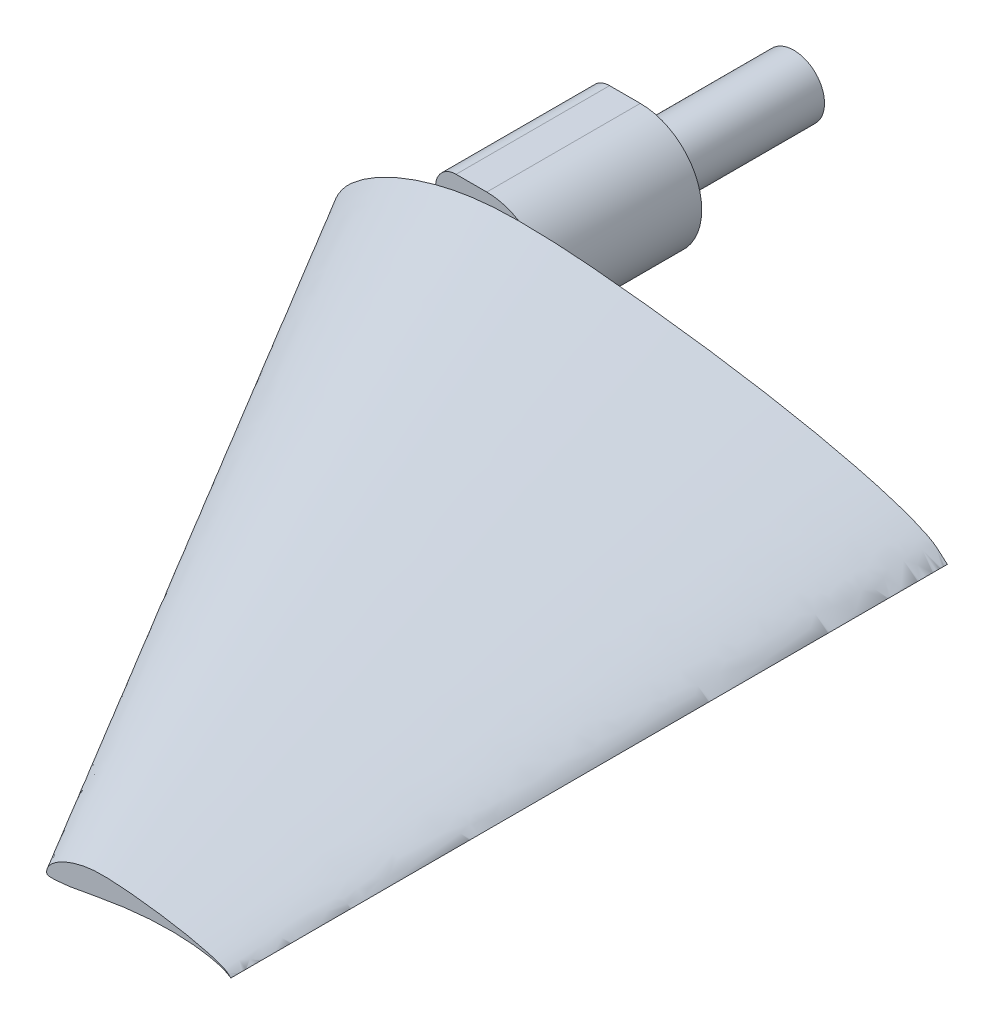
ISO-10303-21;
HEADER;
FILE_DESCRIPTION(('STEP AP214'),'2;1');
FILE_NAME('part.step','',(''),(''),'','','');
FILE_SCHEMA(('AUTOMOTIVE_DESIGN { 1 0 10303 214 1 1 1 1 }'));
ENDSEC;
DATA;
#1=APPLICATION_CONTEXT('core data for automotive mechanical design processes');
#2=APPLICATION_PROTOCOL_DEFINITION('international standard','automotive_design',2000,#1);
#3=PRODUCT_CONTEXT('',#1,'mechanical');
#4=PRODUCT('Part','Part','',(#3));
#5=PRODUCT_RELATED_PRODUCT_CATEGORY('part','',(#4));
#6=PRODUCT_DEFINITION_FORMATION('','',#4);
#7=PRODUCT_DEFINITION_CONTEXT('part definition',#1,'design');
#8=PRODUCT_DEFINITION('design','',#6,#7);
#9=PRODUCT_DEFINITION_SHAPE('','',#8);
#10=(LENGTH_UNIT() NAMED_UNIT(*) SI_UNIT(.MILLI.,.METRE.));
#11=(NAMED_UNIT(*) PLANE_ANGLE_UNIT() SI_UNIT($,.RADIAN.));
#12=(NAMED_UNIT(*) SI_UNIT($,.STERADIAN.) SOLID_ANGLE_UNIT());
#13=UNCERTAINTY_MEASURE_WITH_UNIT(LENGTH_MEASURE(1.E-05),#10,'distance_accuracy_value','');
#14=(GEOMETRIC_REPRESENTATION_CONTEXT(3) GLOBAL_UNCERTAINTY_ASSIGNED_CONTEXT((#13)) GLOBAL_UNIT_ASSIGNED_CONTEXT((#10,
#11,#12)) REPRESENTATION_CONTEXT('',''));
#15=CARTESIAN_POINT('',(0.,0.,0.));
#16=DIRECTION('',(0.,0.,1.));
#17=DIRECTION('',(1.,0.,0.));
#18=AXIS2_PLACEMENT_3D('',#15,#16,#17);
#19=CARTESIAN_POINT('',(0.358648893938825,1.31203835702179,0.));
#20=DIRECTION('',(0.,0.,-1.));
#21=DIRECTION('',(-1.,0.,0.));
#22=AXIS2_PLACEMENT_3D('',#19,#20,#21);
#23=PLANE('',#22);
#24=CARTESIAN_POINT('',(60.,0.,0.));
#25=CARTESIAN_POINT('',(60.0003591967076,0.00152743166866113,0.));
#26=CARTESIAN_POINT('',(59.8031171503171,0.148486190866981,0.));
#27=CARTESIAN_POINT('',(59.6363051275394,0.312157693204799,0.));
#28=CARTESIAN_POINT('',(59.265915035483,0.654017791026096,0.));
#29=CARTESIAN_POINT('',(58.828941407944,1.01769187040323,0.));
#30=CARTESIAN_POINT('',(58.2311986071286,1.38431433802317,0.));
#31=CARTESIAN_POINT('',(57.4879028587413,1.73962008144949,0.));
#32=CARTESIAN_POINT('',(56.5905605509476,2.11038996867272,0.));
#33=CARTESIAN_POINT('',(55.5405906841004,2.49165505155028,0.));
#34=CARTESIAN_POINT('',(54.3426606505066,2.87984653664435,0.));
#35=CARTESIAN_POINT('',(53.0044503542957,3.27530791932623,0.));
#36=CARTESIAN_POINT('',(51.5282398733248,3.65993308110928,0.));
#37=CARTESIAN_POINT('',(49.9318628263046,4.06561454332629,0.));
#38=CARTESIAN_POINT('',(48.2145350695117,4.45252726033602,0.));
#39=CARTESIAN_POINT('',(46.3922162813386,4.8372114388325,0.));
#40=CARTESIAN_POINT('',(44.4741846373565,5.21215240354569,0.));
#41=CARTESIAN_POINT('',(42.4720640696188,5.57436949248205,0.));
#42=CARTESIAN_POINT('',(40.3983436281798,5.92287598001367,0.));
#43=CARTESIAN_POINT('',(38.2650079778576,6.25331693697473,0.));
#44=CARTESIAN_POINT('',(36.0858440170008,6.56630027476171,0.));
#45=CARTESIAN_POINT('',(33.8748202071201,6.85935611065016,0.));
#46=CARTESIAN_POINT('',(31.6479502828675,7.13154383170439,0.));
#47=CARTESIAN_POINT('',(29.4230365764783,7.38479145195094,0.));
#48=CARTESIAN_POINT('',(27.2184980068069,7.61270867154978,0.));
#49=CARTESIAN_POINT('',(25.052294626095,7.81102981614016,0.));
#50=CARTESIAN_POINT('',(22.9396617347882,7.96859227406435,0.));
#51=CARTESIAN_POINT('',(20.8926674686435,8.07697502334032,0.));
#52=CARTESIAN_POINT('',(18.9226999256131,8.12377974427893,0.));
#53=CARTESIAN_POINT('',(17.0398509693804,8.11879768752978,0.));
#54=CARTESIAN_POINT('',(15.2476328415943,8.02660789751006,0.));
#55=CARTESIAN_POINT('',(13.5453512859509,7.839789441016,0.));
#56=CARTESIAN_POINT('',(11.926076695069,7.57562537309296,0.));
#57=CARTESIAN_POINT('',(10.3894182556015,7.23340315512576,0.));
#58=CARTESIAN_POINT('',(8.93695465998708,6.83209986705336,0.));
#59=CARTESIAN_POINT('',(7.57483146116029,6.37882320453374,0.));
#60=CARTESIAN_POINT('',(6.30884164347269,5.88417305863267,0.));
#61=CARTESIAN_POINT('',(5.14685221592727,5.35079958311253,0.));
#62=CARTESIAN_POINT('',(4.09258962341009,4.78953179393415,0.));
#63=CARTESIAN_POINT('',(3.15178940082182,4.20675239007223,0.));
#64=CARTESIAN_POINT('',(2.33035140361199,3.61035853790743,0.));
#65=CARTESIAN_POINT('',(1.62861455630535,3.01299152689761,0.));
#66=CARTESIAN_POINT('',(1.05675527613261,2.40813064719845,0.));
#67=CARTESIAN_POINT('',(0.617494407148315,1.80101400701995,0.));
#68=CARTESIAN_POINT('',(0.2930234664486,1.21037036917539,0.));
#69=CARTESIAN_POINT('',(0.0850719316488285,0.649582218808172,0.));
#70=CARTESIAN_POINT('',(-0.0140169847637187,0.131974925650224,0.));
#71=CARTESIAN_POINT('',(0.0051098577528765,-0.305798157678561,0.));
#72=CARTESIAN_POINT('',(0.117816244960925,-0.707306615975616,0.));
#73=CARTESIAN_POINT('',(0.536763933386814,-0.90661835605631,0.));
#74=CARTESIAN_POINT('',(1.10004460153965,-0.934581165480218,0.));
#75=CARTESIAN_POINT('',(1.8706104555078,-0.961682830343907,0.));
#76=CARTESIAN_POINT('',(2.8396514000118,-0.919895750020732,0.));
#77=CARTESIAN_POINT('',(3.99621535818404,-0.843103830870702,0.));
#78=CARTESIAN_POINT('',(5.3274309804443,-0.720099828376295,0.));
#79=CARTESIAN_POINT('',(6.81967624191513,-0.553670124333049,0.));
#80=CARTESIAN_POINT('',(8.46567456259763,-0.340243437522128,0.));
#81=CARTESIAN_POINT('',(10.2646215673956,-0.0419478858174395,0.));
#82=CARTESIAN_POINT('',(12.2252761749415,0.332109900745339,0.));
#83=CARTESIAN_POINT('',(14.3574403385057,0.739204137605637,0.));
#84=CARTESIAN_POINT('',(16.650692213626,1.16903728804964,0.));
#85=CARTESIAN_POINT('',(19.0906277666481,1.60376835003282,0.));
#86=CARTESIAN_POINT('',(21.6593280235428,2.02708237663987,0.));
#87=CARTESIAN_POINT('',(24.3368648292331,2.42484380478589,0.));
#88=CARTESIAN_POINT('',(27.1001632949703,2.78246131453942,0.));
#89=CARTESIAN_POINT('',(29.9243738514525,3.08952194695553,0.));
#90=CARTESIAN_POINT('',(32.7828181702501,3.33224073356768,0.));
#91=CARTESIAN_POINT('',(35.6468110581785,3.5042984247576,0.));
#92=CARTESIAN_POINT('',(38.4864311413307,3.59888806789702,0.));
#93=CARTESIAN_POINT('',(41.270873524825,3.61083541756505,0.));
#94=CARTESIAN_POINT('',(43.9690733929395,3.53932870712883,0.));
#95=CARTESIAN_POINT('',(46.5501347587453,3.38604192261378,0.));
#96=CARTESIAN_POINT('',(48.9830207247781,3.15295287632235,0.));
#97=CARTESIAN_POINT('',(51.2387663269364,2.84900866508274,0.));
#98=CARTESIAN_POINT('',(53.2880024798237,2.48302860424677,0.));
#99=CARTESIAN_POINT('',(55.1067027969541,2.06726981959666,0.));
#100=CARTESIAN_POINT('',(56.6613494668884,1.62238939798338,0.));
#101=CARTESIAN_POINT('',(57.9336674364374,1.14757460538814,0.));
#102=CARTESIAN_POINT('',(58.8414335563824,0.71305828177372,0.));
#103=CARTESIAN_POINT('',(59.510705283188,0.311289893981384,0.));
#104=CARTESIAN_POINT('',(59.7678107009083,0.155812155482037,0.));
#105=CARTESIAN_POINT('',(59.9996335008558,-0.00155848421639207,0.));
#106=CARTESIAN_POINT('',(60.,0.,0.));
#107=B_SPLINE_CURVE_WITH_KNOTS('',3,(#24,#25,#26,#27,#28,#29,#30,#31,#32,#33,#34,#35,#36,#37,
#38,#39,#40,#41,#42,#43,#44,#45,#46,#47,#48,#49,#50,#51,#52,#53,#54,#55,#56,#57,#58,#59,#60,#61,
#62,#63,#64,#65,#66,#67,#68,#69,#70,#71,#72,#73,#74,#75,#76,#77,#78,#79,#80,#81,#82,#83,#84,#85,
#86,#87,#88,#89,#90,#91,#92,#93,#94,#95,#96,#97,#98,#99,#100,#101,#102,#103,#104,#105,#106),
.UNSPECIFIED.,.T.,.F.,(4,1,1,1,1,1,1,1,1,1,1,1,1,1,1,1,1,1,1,1,1,1,1,1,1,1,1,1,1,1,1,1,1,1,1,1,
1,1,1,1,1,1,1,1,1,1,1,1,1,1,1,1,1,1,1,1,1,1,1,1,1,1,1,1,1,1,1,1,1,1,1,1,1,1,1,1,1,1,1,1,4),(0.,
0.000979678264274593,0.00364886480154598,0.0074835039211375,0.0120952859160778,
0.0175256034270145,0.0240517973546713,0.0317830734940624,0.0406778574448995,0.0507103373936484,
0.0618332736939838,0.0739782064365048,0.0871175142640213,0.101144399967861,0.115989999025582,
0.131569794799979,0.147787764168625,0.164550313847436,0.18175730453571,0.199311377000208,
0.217094506604148,0.234989676272761,0.252856343827104,0.270540067198934,0.287886265256047,
0.304772935778624,0.321100929178702,0.336805584475211,0.351799564707225,0.36603060578736,
0.379615227120614,0.392652524490402,0.405169929353884,0.417171498359163,0.428603104471847,
0.439418554475609,0.449596188777818,0.459101688677971,0.467907493465564,0.475987922499971,
0.48330859579372,0.48987413960304,0.495802885785267,0.501149051620522,0.505902716612247,
0.510046414883828,0.513578959578029,0.51644657759361,0.519349705653263,0.52382301147072,
0.529973454728372,0.537715320706753,0.54696751748529,0.557637047524215,0.569620170444662,
0.582803823079722,0.597246670080713,0.613134757411944,0.630443333580543,0.649055870293966,
0.668822017748496,0.68959473994942,0.711189442398585,0.733426496549274,0.756093941450603,
0.778988394156727,0.80188953968707,0.824566471200233,0.846792174293647,0.868338195473131,
0.888978082822463,0.908491945289234,0.926658714643544,0.943286152105764,0.958169180164938,
0.971135800800317,0.981955610055375,0.990251783989627,0.995852562256305,0.999000404965184,1.),.UNSPECIFIED.);
#108=CARTESIAN_POINT('',(10.0000018144621,7.1202498165083,0.));
#109=VERTEX_POINT('',#108);
#110=CARTESIAN_POINT('',(10.000025993714,-0.0804183263823534,0.));
#111=VERTEX_POINT('',#110);
#112=EDGE_CURVE('E180',#109,#111,#107,.T.);
#113=ORIENTED_EDGE('',*,*,#112,.F.);
#114=CARTESIAN_POINT('',(12.,7.,0.));
#115=DIRECTION('',(0.,0.,-1.));
#116=DIRECTION('',(-1.,0.,0.));
#117=AXIS2_PLACEMENT_3D('',#114,#115,#116);
#118=CIRCLE('',#117,2.);
#119=CARTESIAN_POINT('',(10.,7.,0.));
#120=VERTEX_POINT('',#119);
#121=EDGE_CURVE('E12',#109,#120,#118,.F.);
#122=ORIENTED_EDGE('',*,*,#121,.T.);
#123=DIRECTION('',(0.,-1.,0.));
#124=VECTOR('',#123,1.);
#125=CARTESIAN_POINT('',(10.,9.,0.));
#126=LINE('',#125,#124);
#127=EDGE_CURVE('E156',#120,#111,#126,.T.);
#128=ORIENTED_EDGE('',*,*,#127,.T.);
#129=EDGE_LOOP('',(#113,#122,#128));
#130=FACE_BOUND('',#129,.T.);
#131=ADVANCED_FACE('F47',(#130),#23,.T.);
#132=CARTESIAN_POINT('',(15.,3.,0.));
#133=DIRECTION('',(0.,0.,-1.));
#134=DIRECTION('',(-1.,0.,0.));
#135=AXIS2_PLACEMENT_3D('',#132,#133,#134);
#136=CIRCLE('',#135,6.);
#137=CARTESIAN_POINT('',(18.13055109797,8.11865272424625,0.));
#138=VERTEX_POINT('',#137);
#139=CARTESIAN_POINT('',(20.8980731567327,1.89883608250178,0.));
#140=VERTEX_POINT('',#139);
#141=EDGE_CURVE('E160',#138,#140,#136,.T.);
#142=ORIENTED_EDGE('',*,*,#141,.F.);
#143=EDGE_CURVE('E140',#140,#138,#107,.T.);
#144=ORIENTED_EDGE('',*,*,#143,.F.);
#145=EDGE_LOOP('',(#142,#144));
#146=FACE_BOUND('',#145,.T.);
#147=ADVANCED_FACE('F269',(#146),#23,.T.);
#148=CARTESIAN_POINT('',(42.1075946681816,0.393611507106538,70.));
#149=DIRECTION('',(0.,0.,-1.));
#150=DIRECTION('',(-1.,0.,0.));
#151=AXIS2_PLACEMENT_3D('',#148,#149,#150);
#152=PLANE('',#151);
#153=CARTESIAN_POINT('',(60.,0.,70.));
#154=CARTESIAN_POINT('',(60.0001077590123,0.00045822950059834,70.));
#155=CARTESIAN_POINT('',(59.9409351450951,0.0445458572600942,70.));
#156=CARTESIAN_POINT('',(59.8908915382618,0.0936473079614398,70.));
#157=CARTESIAN_POINT('',(59.7797745106449,0.196205337307829,70.));
#158=CARTESIAN_POINT('',(59.6486824223832,0.305307561120969,70.));
#159=CARTESIAN_POINT('',(59.4693595821386,0.415294301406952,70.));
#160=CARTESIAN_POINT('',(59.2463708576224,0.521886024434847,70.));
#161=CARTESIAN_POINT('',(58.9771681652843,0.633116990601815,70.));
#162=CARTESIAN_POINT('',(58.6621772052301,0.747496515465083,70.));
#163=CARTESIAN_POINT('',(58.302798195152,0.863953960993304,70.));
#164=CARTESIAN_POINT('',(57.9013351062887,0.982592375797868,70.));
#165=CARTESIAN_POINT('',(57.4584719619975,1.09797992433278,70.));
#166=CARTESIAN_POINT('',(56.9795588478914,1.21968436299789,70.));
#167=CARTESIAN_POINT('',(56.4643605208535,1.33575817810081,70.));
#168=CARTESIAN_POINT('',(55.9176648844016,1.45116343164975,70.));
#169=CARTESIAN_POINT('',(55.3422553912069,1.56364572106371,70.));
#170=CARTESIAN_POINT('',(54.7416192208856,1.67231084774462,70.));
#171=CARTESIAN_POINT('',(54.119503088454,1.7768627940041,70.));
#172=CARTESIAN_POINT('',(53.4795023933573,1.87599508109242,70.));
#173=CARTESIAN_POINT('',(52.8257532051002,1.96989008242851,70.));
#174=CARTESIAN_POINT('',(52.162446062136,2.05780683319505,70.));
#175=CARTESIAN_POINT('',(51.4943850848603,2.13946314951132,70.));
#176=CARTESIAN_POINT('',(50.8269109729435,2.21543743558528,70.));
#177=CARTESIAN_POINT('',(50.1655494020421,2.28381260146493,70.));
#178=CARTESIAN_POINT('',(49.5156883878285,2.34330894484205,70.));
#179=CARTESIAN_POINT('',(48.8818985204364,2.39057768221931,70.));
#180=CARTESIAN_POINT('',(48.2678002405931,2.42309250700209,70.));
#181=CARTESIAN_POINT('',(47.6768099776839,2.43713392328368,70.));
#182=CARTESIAN_POINT('',(47.1119552908141,2.43563930625894,70.));
#183=CARTESIAN_POINT('',(46.5742898524783,2.40798236925302,70.));
#184=CARTESIAN_POINT('',(46.0636053857853,2.3519368323048,70.));
#185=CARTESIAN_POINT('',(45.5778230085207,2.27268761192789,70.));
#186=CARTESIAN_POINT('',(45.1168254766805,2.17002094653773,70.));
#187=CARTESIAN_POINT('',(44.6810863979961,2.04962996011601,70.));
#188=CARTESIAN_POINT('',(44.2724494383481,1.91364696136012,70.));
#189=CARTESIAN_POINT('',(43.8926524930418,1.7652519175898,70.));
#190=CARTESIAN_POINT('',(43.5440556647782,1.60523987493376,70.));
#191=CARTESIAN_POINT('',(43.227776887023,1.43685953818025,70.));
#192=CARTESIAN_POINT('',(42.9455368202465,1.26202571702167,70.));
#193=CARTESIAN_POINT('',(42.6991054210836,1.08310756137223,70.));
#194=CARTESIAN_POINT('',(42.4885843668916,0.903897458069282,70.));
#195=CARTESIAN_POINT('',(42.3170265828398,0.722439194159534,70.));
#196=CARTESIAN_POINT('',(42.1852483221445,0.540304202105985,70.));
#197=CARTESIAN_POINT('',(42.0879070399346,0.363111110752618,70.));
#198=CARTESIAN_POINT('',(42.0255215794946,0.194874665642452,70.));
#199=CARTESIAN_POINT('',(41.9957949045709,0.0395924776950672,70.));
#200=CARTESIAN_POINT('',(42.0015329573259,-0.0917394473035684,70.));
#201=CARTESIAN_POINT('',(42.0353448734883,-0.212191984792685,70.));
#202=CARTESIAN_POINT('',(42.161029180016,-0.271985506816893,70.));
#203=CARTESIAN_POINT('',(42.3300133804619,-0.280374349644065,70.));
#204=CARTESIAN_POINT('',(42.5611831366523,-0.288504849103172,70.));
#205=CARTESIAN_POINT('',(42.8518954200035,-0.27596872500622,70.));
#206=CARTESIAN_POINT('',(43.1988646074552,-0.252931149261211,70.));
#207=CARTESIAN_POINT('',(43.5982292941333,-0.216029948512889,70.));
#208=CARTESIAN_POINT('',(44.0459028725745,-0.166101037299915,70.));
#209=CARTESIAN_POINT('',(44.5397023687793,-0.102073031256638,70.));
#210=CARTESIAN_POINT('',(45.0793864702187,-0.0125843657452318,70.));
#211=CARTESIAN_POINT('',(45.6675828524825,0.0996329702236017,70.));
#212=CARTESIAN_POINT('',(46.3072321015517,0.221761241281691,70.));
#213=CARTESIAN_POINT('',(46.9952076640878,0.350711186414893,70.));
#214=CARTESIAN_POINT('',(47.7271883299944,0.481130505009847,70.));
#215=CARTESIAN_POINT('',(48.4977984070628,0.608124712991961,70.));
#216=CARTESIAN_POINT('',(49.3010594487699,0.727453141435768,70.));
#217=CARTESIAN_POINT('',(50.1300489884911,0.834738394361826,70.));
#218=CARTESIAN_POINT('',(50.9773121554357,0.926856584086659,70.));
#219=CARTESIAN_POINT('',(51.834845451075,0.999672220070305,70.));
#220=CARTESIAN_POINT('',(52.6940433174535,1.05128952742728,70.));
#221=CARTESIAN_POINT('',(53.5459293423992,1.07966642036911,70.));
#222=CARTESIAN_POINT('',(54.3812620574475,1.08325062526952,70.));
#223=CARTESIAN_POINT('',(55.1907220178818,1.06179861213865,70.));
#224=CARTESIAN_POINT('',(55.9650404276236,1.01581257678414,70.));
#225=CARTESIAN_POINT('',(56.6949062174334,0.945885862896706,70.));
#226=CARTESIAN_POINT('',(57.3716298980809,0.854702599524822,70.));
#227=CARTESIAN_POINT('',(57.9864007439471,0.744908581274031,70.));
#228=CARTESIAN_POINT('',(58.5320108390862,0.620180945878999,70.));
#229=CARTESIAN_POINT('',(58.9984048400665,0.486716819395014,70.));
#230=CARTESIAN_POINT('',(59.3801002309312,0.344272381616441,70.));
#231=CARTESIAN_POINT('',(59.6524300669147,0.213917484532116,70.));
#232=CARTESIAN_POINT('',(59.8532115849564,0.0933869681944152,70.));
#233=CARTESIAN_POINT('',(59.9303432102725,0.0467436466446112,70.));
#234=CARTESIAN_POINT('',(59.9998900502568,-0.000467545264917618,70.));
#235=CARTESIAN_POINT('',(60.,0.,70.));
#236=B_SPLINE_CURVE_WITH_KNOTS('',3,(#153,#154,#155,#156,#157,#158,#159,#160,#161,#162,#163,
#164,#165,#166,#167,#168,#169,#170,#171,#172,#173,#174,#175,#176,#177,#178,#179,#180,#181,#182,
#183,#184,#185,#186,#187,#188,#189,#190,#191,#192,#193,#194,#195,#196,#197,#198,#199,#200,#201,
#202,#203,#204,#205,#206,#207,#208,#209,#210,#211,#212,#213,#214,#215,#216,#217,#218,#219,#220,
#221,#222,#223,#224,#225,#226,#227,#228,#229,#230,#231,#232,#233,#234,#235),.UNSPECIFIED.,.T.,
.F.,(4,1,1,1,1,1,1,1,1,1,1,1,1,1,1,1,1,1,1,1,1,1,1,1,1,1,1,1,1,1,1,1,1,1,1,1,1,1,1,1,1,1,1,1,1,
1,1,1,1,1,1,1,1,1,1,1,1,1,1,1,1,1,1,1,1,1,1,1,1,1,1,1,1,1,1,1,1,1,1,1,4),(0.,
0.000979678264274593,0.00364886480154598,0.0074835039211375,0.0120952859160778,
0.0175256034270145,0.0240517973546713,0.0317830734940624,0.0406778574448995,0.0507103373936484,
0.0618332736939838,0.0739782064365048,0.0871175142640213,0.101144399967861,0.115989999025582,
0.131569794799979,0.147787764168625,0.164550313847436,0.18175730453571,0.199311377000208,
0.217094506604148,0.234989676272761,0.252856343827104,0.270540067198934,0.287886265256047,
0.304772935778624,0.321100929178702,0.336805584475211,0.351799564707225,0.36603060578736,
0.379615227120614,0.392652524490402,0.405169929353884,0.417171498359163,0.428603104471847,
0.439418554475609,0.449596188777818,0.459101688677971,0.467907493465564,0.475987922499971,
0.48330859579372,0.48987413960304,0.495802885785267,0.501149051620522,0.505902716612247,
0.510046414883828,0.513578959578029,0.51644657759361,0.519349705653263,0.52382301147072,
0.529973454728372,0.537715320706753,0.54696751748529,0.557637047524215,0.569620170444662,
0.582803823079722,0.597246670080713,0.613134757411944,0.630443333580543,0.649055870293966,
0.668822017748496,0.68959473994942,0.711189442398585,0.733426496549274,0.756093941450603,
0.778988394156727,0.80188953968707,0.824566471200233,0.846792174293647,0.868338195473131,
0.888978082822463,0.908491945289234,0.926658714643544,0.943286152105764,0.958169180164938,
0.971135800800317,0.981955610055375,0.990251783989627,0.995852562256305,0.999000404965184,1.),.UNSPECIFIED.);
#237=CARTESIAN_POINT('',(60.,0.,70.));
#238=VERTEX_POINT('',#237);
#239=EDGE_CURVE('E137',#238,#238,#236,.T.);
#240=ORIENTED_EDGE('',*,*,#239,.T.);
#241=EDGE_LOOP('',(#240));
#242=FACE_BOUND('',#241,.T.);
#243=ADVANCED_FACE('F266',(#242),#152,.F.);
#244=CARTESIAN_POINT('',(60.,0.,70.));
#245=CARTESIAN_POINT('',(60.,0.,0.));
#246=CARTESIAN_POINT('',(59.9998900502568,-0.000467545264917618,70.));
#247=CARTESIAN_POINT('',(59.9996335008558,-0.00155848421639207,0.));
#248=CARTESIAN_POINT('',(59.9303432102725,0.0467436466446112,70.));
#249=CARTESIAN_POINT('',(59.7678107009083,0.155812155482037,0.));
#250=CARTESIAN_POINT('',(59.8532115849564,0.0933869681944152,70.));
#251=CARTESIAN_POINT('',(59.510705283188,0.311289893981384,0.));
#252=CARTESIAN_POINT('',(59.6524300669147,0.213917484532116,70.));
#253=CARTESIAN_POINT('',(58.8414335563824,0.71305828177372,0.));
#254=CARTESIAN_POINT('',(59.3801002309312,0.344272381616441,70.));
#255=CARTESIAN_POINT('',(57.9336674364374,1.14757460538814,0.));
#256=CARTESIAN_POINT('',(58.9984048400665,0.486716819395014,70.));
#257=CARTESIAN_POINT('',(56.6613494668884,1.62238939798338,0.));
#258=CARTESIAN_POINT('',(58.5320108390862,0.620180945878999,70.));
#259=CARTESIAN_POINT('',(55.1067027969541,2.06726981959666,0.));
#260=CARTESIAN_POINT('',(57.9864007439471,0.744908581274031,70.));
#261=CARTESIAN_POINT('',(53.2880024798237,2.48302860424677,0.));
#262=CARTESIAN_POINT('',(57.3716298980809,0.854702599524822,70.));
#263=CARTESIAN_POINT('',(51.2387663269364,2.84900866508274,0.));
#264=CARTESIAN_POINT('',(56.6949062174334,0.945885862896706,70.));
#265=CARTESIAN_POINT('',(48.9830207247781,3.15295287632235,0.));
#266=CARTESIAN_POINT('',(55.9650404276236,1.01581257678414,70.));
#267=CARTESIAN_POINT('',(46.5501347587453,3.38604192261378,0.));
#268=CARTESIAN_POINT('',(55.1907220178818,1.06179861213865,70.));
#269=CARTESIAN_POINT('',(43.9690733929395,3.53932870712883,0.));
#270=CARTESIAN_POINT('',(54.3812620574475,1.08325062526952,70.));
#271=CARTESIAN_POINT('',(41.270873524825,3.61083541756505,0.));
#272=CARTESIAN_POINT('',(53.5459293423992,1.07966642036911,70.));
#273=CARTESIAN_POINT('',(38.4864311413307,3.59888806789702,0.));
#274=CARTESIAN_POINT('',(52.6940433174535,1.05128952742728,70.));
#275=CARTESIAN_POINT('',(35.6468110581785,3.5042984247576,0.));
#276=CARTESIAN_POINT('',(51.834845451075,0.999672220070305,70.));
#277=CARTESIAN_POINT('',(32.7828181702501,3.33224073356768,0.));
#278=CARTESIAN_POINT('',(50.9773121554357,0.926856584086659,70.));
#279=CARTESIAN_POINT('',(29.9243738514525,3.08952194695553,0.));
#280=CARTESIAN_POINT('',(50.1300489884911,0.834738394361826,70.));
#281=CARTESIAN_POINT('',(27.1001632949703,2.78246131453942,0.));
#282=CARTESIAN_POINT('',(49.3010594487699,0.727453141435768,70.));
#283=CARTESIAN_POINT('',(24.3368648292331,2.42484380478589,0.));
#284=CARTESIAN_POINT('',(48.4977984070628,0.608124712991961,70.));
#285=CARTESIAN_POINT('',(21.6593280235428,2.02708237663987,0.));
#286=CARTESIAN_POINT('',(47.7271883299944,0.481130505009847,70.));
#287=CARTESIAN_POINT('',(19.0906277666481,1.60376835003282,0.));
#288=CARTESIAN_POINT('',(46.9952076640878,0.350711186414893,70.));
#289=CARTESIAN_POINT('',(16.650692213626,1.16903728804964,0.));
#290=CARTESIAN_POINT('',(46.3072321015517,0.221761241281691,70.));
#291=CARTESIAN_POINT('',(14.3574403385057,0.739204137605637,0.));
#292=CARTESIAN_POINT('',(45.6675828524825,0.0996329702236017,70.));
#293=CARTESIAN_POINT('',(12.2252761749415,0.332109900745339,0.));
#294=CARTESIAN_POINT('',(45.0793864702187,-0.0125843657452318,70.));
#295=CARTESIAN_POINT('',(10.2646215673956,-0.0419478858174395,0.));
#296=CARTESIAN_POINT('',(44.5397023687793,-0.102073031256638,70.));
#297=CARTESIAN_POINT('',(8.46567456259763,-0.340243437522128,0.));
#298=CARTESIAN_POINT('',(44.0459028725745,-0.166101037299915,70.));
#299=CARTESIAN_POINT('',(6.81967624191513,-0.553670124333049,0.));
#300=CARTESIAN_POINT('',(43.5982292941333,-0.216029948512889,70.));
#301=CARTESIAN_POINT('',(5.3274309804443,-0.720099828376295,0.));
#302=CARTESIAN_POINT('',(43.1988646074552,-0.252931149261211,70.));
#303=CARTESIAN_POINT('',(3.99621535818404,-0.843103830870702,0.));
#304=CARTESIAN_POINT('',(42.8518954200035,-0.27596872500622,70.));
#305=CARTESIAN_POINT('',(2.8396514000118,-0.919895750020732,0.));
#306=CARTESIAN_POINT('',(42.5611831366523,-0.288504849103172,70.));
#307=CARTESIAN_POINT('',(1.8706104555078,-0.961682830343907,0.));
#308=CARTESIAN_POINT('',(42.3300133804619,-0.280374349644065,70.));
#309=CARTESIAN_POINT('',(1.10004460153965,-0.934581165480218,0.));
#310=CARTESIAN_POINT('',(42.161029180016,-0.271985506816893,70.));
#311=CARTESIAN_POINT('',(0.536763933386814,-0.90661835605631,0.));
#312=CARTESIAN_POINT('',(42.0353448734883,-0.212191984792685,70.));
#313=CARTESIAN_POINT('',(0.117816244960925,-0.707306615975616,0.));
#314=CARTESIAN_POINT('',(42.0015329573259,-0.0917394473035684,70.));
#315=CARTESIAN_POINT('',(0.0051098577528765,-0.305798157678561,0.));
#316=CARTESIAN_POINT('',(41.9957949045709,0.0395924776950672,70.));
#317=CARTESIAN_POINT('',(-0.0140169847637187,0.131974925650224,0.));
#318=CARTESIAN_POINT('',(42.0255215794946,0.194874665642452,70.));
#319=CARTESIAN_POINT('',(0.0850719316488285,0.649582218808172,0.));
#320=CARTESIAN_POINT('',(42.0879070399346,0.363111110752618,70.));
#321=CARTESIAN_POINT('',(0.2930234664486,1.21037036917539,0.));
#322=CARTESIAN_POINT('',(42.1852483221445,0.540304202105985,70.));
#323=CARTESIAN_POINT('',(0.617494407148315,1.80101400701995,0.));
#324=CARTESIAN_POINT('',(42.3170265828398,0.722439194159534,70.));
#325=CARTESIAN_POINT('',(1.05675527613261,2.40813064719845,0.));
#326=CARTESIAN_POINT('',(42.4885843668916,0.903897458069282,70.));
#327=CARTESIAN_POINT('',(1.62861455630535,3.01299152689761,0.));
#328=CARTESIAN_POINT('',(42.6991054210836,1.08310756137223,70.));
#329=CARTESIAN_POINT('',(2.33035140361199,3.61035853790743,0.));
#330=CARTESIAN_POINT('',(42.9455368202465,1.26202571702167,70.));
#331=CARTESIAN_POINT('',(3.15178940082182,4.20675239007223,0.));
#332=CARTESIAN_POINT('',(43.227776887023,1.43685953818025,70.));
#333=CARTESIAN_POINT('',(4.09258962341009,4.78953179393415,0.));
#334=CARTESIAN_POINT('',(43.5440556647782,1.60523987493376,70.));
#335=CARTESIAN_POINT('',(5.14685221592727,5.35079958311253,0.));
#336=CARTESIAN_POINT('',(43.8926524930418,1.7652519175898,70.));
#337=CARTESIAN_POINT('',(6.30884164347269,5.88417305863267,0.));
#338=CARTESIAN_POINT('',(44.2724494383481,1.91364696136012,70.));
#339=CARTESIAN_POINT('',(7.57483146116029,6.37882320453374,0.));
#340=CARTESIAN_POINT('',(44.6810863979961,2.04962996011601,70.));
#341=CARTESIAN_POINT('',(8.93695465998708,6.83209986705336,0.));
#342=CARTESIAN_POINT('',(45.1168254766805,2.17002094653773,70.));
#343=CARTESIAN_POINT('',(10.3894182556015,7.23340315512576,0.));
#344=CARTESIAN_POINT('',(45.5778230085207,2.27268761192789,70.));
#345=CARTESIAN_POINT('',(11.926076695069,7.57562537309296,0.));
#346=CARTESIAN_POINT('',(46.0636053857853,2.3519368323048,70.));
#347=CARTESIAN_POINT('',(13.5453512859509,7.839789441016,0.));
#348=CARTESIAN_POINT('',(46.5742898524783,2.40798236925302,70.));
#349=CARTESIAN_POINT('',(15.2476328415943,8.02660789751006,0.));
#350=CARTESIAN_POINT('',(47.1119552908141,2.43563930625894,70.));
#351=CARTESIAN_POINT('',(17.0398509693804,8.11879768752978,0.));
#352=CARTESIAN_POINT('',(47.6768099776839,2.43713392328368,70.));
#353=CARTESIAN_POINT('',(18.9226999256131,8.12377974427893,0.));
#354=CARTESIAN_POINT('',(48.2678002405931,2.42309250700209,70.));
#355=CARTESIAN_POINT('',(20.8926674686435,8.07697502334032,0.));
#356=CARTESIAN_POINT('',(48.8818985204364,2.39057768221931,70.));
#357=CARTESIAN_POINT('',(22.9396617347882,7.96859227406435,0.));
#358=CARTESIAN_POINT('',(49.5156883878285,2.34330894484205,70.));
#359=CARTESIAN_POINT('',(25.052294626095,7.81102981614016,0.));
#360=CARTESIAN_POINT('',(50.1655494020421,2.28381260146493,70.));
#361=CARTESIAN_POINT('',(27.2184980068069,7.61270867154978,0.));
#362=CARTESIAN_POINT('',(50.8269109729435,2.21543743558528,70.));
#363=CARTESIAN_POINT('',(29.4230365764783,7.38479145195094,0.));
#364=CARTESIAN_POINT('',(51.4943850848603,2.13946314951132,70.));
#365=CARTESIAN_POINT('',(31.6479502828675,7.13154383170439,0.));
#366=CARTESIAN_POINT('',(52.162446062136,2.05780683319505,70.));
#367=CARTESIAN_POINT('',(33.8748202071201,6.85935611065016,0.));
#368=CARTESIAN_POINT('',(52.8257532051002,1.96989008242851,70.));
#369=CARTESIAN_POINT('',(36.0858440170008,6.56630027476171,0.));
#370=CARTESIAN_POINT('',(53.4795023933573,1.87599508109242,70.));
#371=CARTESIAN_POINT('',(38.2650079778576,6.25331693697473,0.));
#372=CARTESIAN_POINT('',(54.119503088454,1.7768627940041,70.));
#373=CARTESIAN_POINT('',(40.3983436281798,5.92287598001367,0.));
#374=CARTESIAN_POINT('',(54.7416192208856,1.67231084774462,70.));
#375=CARTESIAN_POINT('',(42.4720640696188,5.57436949248205,0.));
#376=CARTESIAN_POINT('',(55.3422553912069,1.56364572106371,70.));
#377=CARTESIAN_POINT('',(44.4741846373565,5.21215240354569,0.));
#378=CARTESIAN_POINT('',(55.9176648844016,1.45116343164975,70.));
#379=CARTESIAN_POINT('',(46.3922162813386,4.8372114388325,0.));
#380=CARTESIAN_POINT('',(56.4643605208535,1.33575817810081,70.));
#381=CARTESIAN_POINT('',(48.2145350695117,4.45252726033602,0.));
#382=CARTESIAN_POINT('',(56.9795588478914,1.21968436299789,70.));
#383=CARTESIAN_POINT('',(49.9318628263046,4.06561454332629,0.));
#384=CARTESIAN_POINT('',(57.4584719619975,1.09797992433278,70.));
#385=CARTESIAN_POINT('',(51.5282398733248,3.65993308110928,0.));
#386=CARTESIAN_POINT('',(57.9013351062887,0.982592375797868,70.));
#387=CARTESIAN_POINT('',(53.0044503542957,3.27530791932623,0.));
#388=CARTESIAN_POINT('',(58.302798195152,0.863953960993304,70.));
#389=CARTESIAN_POINT('',(54.3426606505066,2.87984653664435,0.));
#390=CARTESIAN_POINT('',(58.6621772052301,0.747496515465083,70.));
#391=CARTESIAN_POINT('',(55.5405906841004,2.49165505155028,0.));
#392=CARTESIAN_POINT('',(58.9771681652843,0.633116990601815,70.));
#393=CARTESIAN_POINT('',(56.5905605509476,2.11038996867272,0.));
#394=CARTESIAN_POINT('',(59.2463708576224,0.521886024434847,70.));
#395=CARTESIAN_POINT('',(57.4879028587413,1.73962008144949,0.));
#396=CARTESIAN_POINT('',(59.4693595821386,0.415294301406952,70.));
#397=CARTESIAN_POINT('',(58.2311986071286,1.38431433802317,0.));
#398=CARTESIAN_POINT('',(59.6486824223832,0.305307561120969,70.));
#399=CARTESIAN_POINT('',(58.828941407944,1.01769187040323,0.));
#400=CARTESIAN_POINT('',(59.7797745106449,0.196205337307829,70.));
#401=CARTESIAN_POINT('',(59.265915035483,0.654017791026096,0.));
#402=CARTESIAN_POINT('',(59.8908915382618,0.0936473079614398,70.));
#403=CARTESIAN_POINT('',(59.6363051275394,0.312157693204799,0.));
#404=CARTESIAN_POINT('',(59.9409351450951,0.0445458572600942,70.));
#405=CARTESIAN_POINT('',(59.8031171503171,0.148486190866981,0.));
#406=CARTESIAN_POINT('',(60.0001077590123,0.000458229500598223,70.));
#407=CARTESIAN_POINT('',(60.0003591967076,0.00152743166866073,0.));
#408=CARTESIAN_POINT('',(60.,0.,70.));
#409=CARTESIAN_POINT('',(60.,0.,0.));
#410=B_SPLINE_SURFACE_WITH_KNOTS('',3,1,((#244,#245),(#246,#247),(#248,#249),(#250,#251),(#252,
#253),(#254,#255),(#256,#257),(#258,#259),(#260,#261),(#262,#263),(#264,#265),(#266,#267),(#268,
#269),(#270,#271),(#272,#273),(#274,#275),(#276,#277),(#278,#279),(#280,#281),(#282,#283),(#284,
#285),(#286,#287),(#288,#289),(#290,#291),(#292,#293),(#294,#295),(#296,#297),(#298,#299),(#300,
#301),(#302,#303),(#304,#305),(#306,#307),(#308,#309),(#310,#311),(#312,#313),(#314,#315),(#316,
#317),(#318,#319),(#320,#321),(#322,#323),(#324,#325),(#326,#327),(#328,#329),(#330,#331),(#332,
#333),(#334,#335),(#336,#337),(#338,#339),(#340,#341),(#342,#343),(#344,#345),(#346,#347),(#348,
#349),(#350,#351),(#352,#353),(#354,#355),(#356,#357),(#358,#359),(#360,#361),(#362,#363),(#364,
#365),(#366,#367),(#368,#369),(#370,#371),(#372,#373),(#374,#375),(#376,#377),(#378,#379),(#380,
#381),(#382,#383),(#384,#385),(#386,#387),(#388,#389),(#390,#391),(#392,#393),(#394,#395),(#396,
#397),(#398,#399),(#400,#401),(#402,#403),(#404,#405),(#406,#407),(#408,#409)),.UNSPECIFIED.,
.T.,.F.,.F.,(4,1,1,1,1,1,1,1,1,1,1,1,1,1,1,1,1,1,1,1,1,1,1,1,1,1,1,1,1,1,1,1,1,1,1,1,1,1,1,1,1,
1,1,1,1,1,1,1,1,1,1,1,1,1,1,1,1,1,1,1,1,1,1,1,1,1,1,1,1,1,1,1,1,1,1,1,1,1,1,1,4),(2,2),(0.,
0.000999595034815837,0.00414743774369519,0.00974821601037268,0.0180443899446245,
0.0288641991996833,0.0418308198350615,0.0567138478942355,0.0733412853564563,0.0915080547107664,
0.111021917177537,0.131661804526869,0.153207825706353,0.175433528799767,0.19811046031293,
0.221011605843273,0.243906058549397,0.266573503450726,0.288810557601415,0.31040526005058,
0.331177982251504,0.350944129706034,0.369556666419457,0.386865242588056,0.402753329919287,
0.417196176920278,0.430379829555338,0.442362952475785,0.45303248251471,0.462284679293247,
0.470026545271628,0.47617698852928,0.480650294346737,0.48355342240639,0.486421040421971,
0.489953585116172,0.494097283387753,0.498850948379478,0.504197114214733,0.51012586039696,
0.51669140420628,0.524012077500029,0.532092506534436,0.540898311322029,0.550403811222182,
0.560581445524391,0.571396895528153,0.582828501640837,0.594830070646116,0.607347475509598,
0.620384772879386,0.63396939421264,0.648200435292775,0.663194415524789,0.678899070821298,
0.695227064221376,0.712113734743953,0.729459932801066,0.747143656172896,0.765010323727239,
0.782905493395852,0.800688622999792,0.81824269546429,0.835449686152564,0.852212235831375,
0.868430205200021,0.884010000974418,0.898855600032139,0.912882485735979,0.926021793563495,
0.938166726306016,0.949289662606352,0.959322142555101,0.968216926505938,0.975948202645329,
0.982474396572986,0.987904714083922,0.992516496078862,0.996351135198454,0.999020321735725,1.),
(0.,1.),.UNSPECIFIED.);
#411=EDGE_CURVE('E51',#138,#109,#107,.T.);
#412=EDGE_CURVE('E161',#111,#140,#107,.T.);
#413=ORIENTED_EDGE('',*,*,#239,.F.);
#414=EDGE_LOOP('',(#413));
#415=FACE_BOUND('',#414,.T.);
#416=ORIENTED_EDGE('',*,*,#411,.T.);
#417=ORIENTED_EDGE('',*,*,#112,.T.);
#418=ORIENTED_EDGE('',*,*,#412,.T.);
#419=ORIENTED_EDGE('',*,*,#143,.T.);
#420=EDGE_LOOP('',(#416,#417,#418,#419));
#421=FACE_BOUND('',#420,.T.);
#422=ADVANCED_FACE('F234',(#415,#421),#410,.T.);
#423=CARTESIAN_POINT('',(15.,3.,0.));
#424=DIRECTION('',(0.,0.,-1.));
#425=DIRECTION('',(-1.,0.,0.));
#426=AXIS2_PLACEMENT_3D('',#423,#424,#425);
#427=PLANE('',#426);
#428=CARTESIAN_POINT('',(10.,-0.999999999999999,0.));
#429=VERTEX_POINT('',#428);
#430=EDGE_CURVE('E121',#111,#429,#126,.T.);
#431=ORIENTED_EDGE('',*,*,#430,.T.);
#432=CARTESIAN_POINT('',(12.,-0.999999999999999,0.));
#433=DIRECTION('',(0.,0.,-1.));
#434=DIRECTION('',(-1.,0.,0.));
#435=AXIS2_PLACEMENT_3D('',#432,#433,#434);
#436=CIRCLE('',#435,2.);
#437=CARTESIAN_POINT('',(12.,-3.,0.));
#438=VERTEX_POINT('',#437);
#439=EDGE_CURVE('E167',#429,#438,#436,.F.);
#440=ORIENTED_EDGE('',*,*,#439,.T.);
#441=DIRECTION('',(1.,0.,0.));
#442=VECTOR('',#441,1.);
#443=CARTESIAN_POINT('',(10.,-3.,0.));
#444=LINE('',#443,#442);
#445=CARTESIAN_POINT('',(15.,-3.,0.));
#446=VERTEX_POINT('',#445);
#447=EDGE_CURVE('E148',#438,#446,#444,.T.);
#448=ORIENTED_EDGE('',*,*,#447,.T.);
#449=EDGE_CURVE('E211',#140,#446,#136,.T.);
#450=ORIENTED_EDGE('',*,*,#449,.F.);
#451=ORIENTED_EDGE('',*,*,#412,.F.);
#452=EDGE_LOOP('',(#431,#440,#448,#450,#451));
#453=FACE_BOUND('',#452,.T.);
#454=ADVANCED_FACE('F223',(#453),#427,.F.);
#455=DIRECTION('',(1.,0.,0.));
#456=VECTOR('',#455,1.);
#457=CARTESIAN_POINT('',(10.,9.,0.));
#458=LINE('',#457,#456);
#459=CARTESIAN_POINT('',(12.,9.,0.));
#460=VERTEX_POINT('',#459);
#461=CARTESIAN_POINT('',(15.,9.,0.));
#462=VERTEX_POINT('',#461);
#463=EDGE_CURVE('E135',#460,#462,#458,.T.);
#464=ORIENTED_EDGE('',*,*,#463,.F.);
#465=CARTESIAN_POINT('',(12.,7.,0.));
#466=DIRECTION('',(0.,0.,-1.));
#467=DIRECTION('',(-1.,0.,0.));
#468=AXIS2_PLACEMENT_3D('',#465,#466,#467);
#469=CIRCLE('',#468,2.);
#470=EDGE_CURVE('E57',#460,#109,#469,.F.);
#471=ORIENTED_EDGE('',*,*,#470,.T.);
#472=ORIENTED_EDGE('',*,*,#411,.F.);
#473=EDGE_CURVE('E149',#462,#138,#136,.T.);
#474=ORIENTED_EDGE('',*,*,#473,.F.);
#475=EDGE_LOOP('',(#464,#471,#472,#474));
#476=FACE_BOUND('',#475,.T.);
#477=ADVANCED_FACE('F233',(#476),#427,.F.);
#478=CARTESIAN_POINT('',(10.,9.,-15.));
#479=DIRECTION('',(0.,-1.,0.));
#480=DIRECTION('',(1.,0.,0.));
#481=AXIS2_PLACEMENT_3D('',#478,#479,#480);
#482=PLANE('',#481);
#483=DIRECTION('',(1.,0.,0.));
#484=VECTOR('',#483,1.);
#485=CARTESIAN_POINT('',(10.,9.,-15.));
#486=LINE('',#485,#484);
#487=CARTESIAN_POINT('',(12.,9.,-15.));
#488=VERTEX_POINT('',#487);
#489=CARTESIAN_POINT('',(15.,9.,-15.));
#490=VERTEX_POINT('',#489);
#491=EDGE_CURVE('E113',#488,#490,#486,.T.);
#492=ORIENTED_EDGE('',*,*,#491,.F.);
#493=DIRECTION('',(0.,0.,1.));
#494=VECTOR('',#493,1.);
#495=CARTESIAN_POINT('',(12.,9.,0.));
#496=LINE('',#495,#494);
#497=EDGE_CURVE('E174',#488,#460,#496,.T.);
#498=ORIENTED_EDGE('',*,*,#497,.T.);
#499=ORIENTED_EDGE('',*,*,#463,.T.);
#500=DIRECTION('',(0.,0.,1.));
#501=VECTOR('',#500,1.);
#502=CARTESIAN_POINT('',(15.,9.,-15.));
#503=LINE('',#502,#501);
#504=EDGE_CURVE('E127',#490,#462,#503,.T.);
#505=ORIENTED_EDGE('',*,*,#504,.F.);
#506=EDGE_LOOP('',(#492,#498,#499,#505));
#507=FACE_BOUND('',#506,.T.);
#508=ADVANCED_FACE('F133',(#507),#482,.F.);
#509=CARTESIAN_POINT('',(15.,3.,-15.));
#510=DIRECTION('',(0.,0.,1.));
#511=DIRECTION('',(1.,0.,0.));
#512=AXIS2_PLACEMENT_3D('',#509,#510,#511);
#513=CYLINDRICAL_SURFACE('',#512,6.);
#514=ORIENTED_EDGE('',*,*,#473,.T.);
#515=ORIENTED_EDGE('',*,*,#141,.T.);
#516=ORIENTED_EDGE('',*,*,#449,.T.);
#517=DIRECTION('',(0.,0.,1.));
#518=VECTOR('',#517,1.);
#519=CARTESIAN_POINT('',(15.,-3.,-15.));
#520=LINE('',#519,#518);
#521=CARTESIAN_POINT('',(15.,-3.,-15.));
#522=VERTEX_POINT('',#521);
#523=EDGE_CURVE('E130',#522,#446,#520,.T.);
#524=ORIENTED_EDGE('',*,*,#523,.F.);
#525=CARTESIAN_POINT('',(15.,3.,-15.));
#526=DIRECTION('',(0.,0.,-1.));
#527=DIRECTION('',(-1.,0.,0.));
#528=AXIS2_PLACEMENT_3D('',#525,#526,#527);
#529=CIRCLE('',#528,6.);
#530=EDGE_CURVE('E117',#490,#522,#529,.T.);
#531=ORIENTED_EDGE('',*,*,#530,.F.);
#532=ORIENTED_EDGE('',*,*,#504,.T.);
#533=EDGE_LOOP('',(#514,#515,#516,#524,#531,#532));
#534=FACE_BOUND('',#533,.T.);
#535=ADVANCED_FACE('F126',(#534),#513,.T.);
#536=CARTESIAN_POINT('',(10.,-3.,-15.));
#537=DIRECTION('',(0.,-1.,0.));
#538=DIRECTION('',(1.,0.,0.));
#539=AXIS2_PLACEMENT_3D('',#536,#537,#538);
#540=PLANE('',#539);
#541=ORIENTED_EDGE('',*,*,#447,.F.);
#542=DIRECTION('',(0.,0.,1.));
#543=VECTOR('',#542,1.);
#544=CARTESIAN_POINT('',(12.,-3.,-15.));
#545=LINE('',#544,#543);
#546=CARTESIAN_POINT('',(12.,-3.,-15.));
#547=VERTEX_POINT('',#546);
#548=EDGE_CURVE('E169',#438,#547,#545,.F.);
#549=ORIENTED_EDGE('',*,*,#548,.T.);
#550=DIRECTION('',(1.,0.,0.));
#551=VECTOR('',#550,1.);
#552=CARTESIAN_POINT('',(10.,-3.,-15.));
#553=LINE('',#552,#551);
#554=EDGE_CURVE('E131',#547,#522,#553,.T.);
#555=ORIENTED_EDGE('',*,*,#554,.T.);
#556=ORIENTED_EDGE('',*,*,#523,.T.);
#557=EDGE_LOOP('',(#541,#549,#555,#556));
#558=FACE_BOUND('',#557,.T.);
#559=ADVANCED_FACE('F316',(#558),#540,.T.);
#560=CARTESIAN_POINT('',(10.,9.,-15.));
#561=DIRECTION('',(-1.,0.,0.));
#562=DIRECTION('',(0.,0.,1.));
#563=AXIS2_PLACEMENT_3D('',#560,#561,#562);
#564=PLANE('',#563);
#565=DIRECTION('',(0.,-1.,0.));
#566=VECTOR('',#565,1.);
#567=CARTESIAN_POINT('',(10.,9.,-15.));
#568=LINE('',#567,#566);
#569=CARTESIAN_POINT('',(10.,7.,-15.));
#570=VERTEX_POINT('',#569);
#571=CARTESIAN_POINT('',(10.,-0.999999999999999,-15.));
#572=VERTEX_POINT('',#571);
#573=EDGE_CURVE('E142',#570,#572,#568,.T.);
#574=ORIENTED_EDGE('',*,*,#573,.T.);
#575=DIRECTION('',(0.,0.,1.));
#576=VECTOR('',#575,1.);
#577=CARTESIAN_POINT('',(10.,-0.999999999999999,-15.));
#578=LINE('',#577,#576);
#579=EDGE_CURVE('E164',#572,#429,#578,.T.);
#580=ORIENTED_EDGE('',*,*,#579,.T.);
#581=ORIENTED_EDGE('',*,*,#430,.F.);
#582=ORIENTED_EDGE('',*,*,#127,.F.);
#583=DIRECTION('',(0.,0.,1.));
#584=VECTOR('',#583,1.);
#585=CARTESIAN_POINT('',(10.,7.,-15.));
#586=LINE('',#585,#584);
#587=EDGE_CURVE('E159',#120,#570,#586,.F.);
#588=ORIENTED_EDGE('',*,*,#587,.T.);
#589=EDGE_LOOP('',(#574,#580,#581,#582,#588));
#590=FACE_BOUND('',#589,.T.);
#591=ADVANCED_FACE('F237',(#590),#564,.T.);
#592=CARTESIAN_POINT('',(15.,3.,-15.));
#593=DIRECTION('',(0.,0.,-1.));
#594=DIRECTION('',(-1.,0.,0.));
#595=AXIS2_PLACEMENT_3D('',#592,#593,#594);
#596=PLANE('',#595);
#597=CARTESIAN_POINT('',(15.,3.,-15.));
#598=DIRECTION('',(0.,0.,-1.));
#599=DIRECTION('',(-1.,0.,0.));
#600=AXIS2_PLACEMENT_3D('',#597,#598,#599);
#601=CIRCLE('',#600,3.);
#602=CARTESIAN_POINT('',(12.,3.,-15.));
#603=VERTEX_POINT('',#602);
#604=EDGE_CURVE('E299',#603,#603,#601,.T.);
#605=ORIENTED_EDGE('',*,*,#604,.F.);
#606=EDGE_LOOP('',(#605));
#607=FACE_BOUND('',#606,.T.);
#608=ORIENTED_EDGE('',*,*,#554,.F.);
#609=CARTESIAN_POINT('',(12.,-0.999999999999999,-15.));
#610=DIRECTION('',(0.,0.,-1.));
#611=DIRECTION('',(-1.,0.,0.));
#612=AXIS2_PLACEMENT_3D('',#609,#610,#611);
#613=CIRCLE('',#612,2.);
#614=EDGE_CURVE('E172',#547,#572,#613,.T.);
#615=ORIENTED_EDGE('',*,*,#614,.T.);
#616=ORIENTED_EDGE('',*,*,#573,.F.);
#617=CARTESIAN_POINT('',(12.,7.,-15.));
#618=DIRECTION('',(0.,0.,-1.));
#619=DIRECTION('',(-1.,0.,0.));
#620=AXIS2_PLACEMENT_3D('',#617,#618,#619);
#621=CIRCLE('',#620,2.);
#622=EDGE_CURVE('E72',#570,#488,#621,.T.);
#623=ORIENTED_EDGE('',*,*,#622,.T.);
#624=ORIENTED_EDGE('',*,*,#491,.T.);
#625=ORIENTED_EDGE('',*,*,#530,.T.);
#626=EDGE_LOOP('',(#608,#615,#616,#623,#624,#625));
#627=FACE_BOUND('',#626,.T.);
#628=ADVANCED_FACE('F116',(#607,#627),#596,.T.);
#629=CARTESIAN_POINT('',(15.,3.,-30.));
#630=DIRECTION('',(0.,0.,1.));
#631=DIRECTION('',(1.,0.,0.));
#632=AXIS2_PLACEMENT_3D('',#629,#630,#631);
#633=CYLINDRICAL_SURFACE('',#632,3.);
#634=CARTESIAN_POINT('',(15.,3.,-30.));
#635=DIRECTION('',(0.,0.,-1.));
#636=DIRECTION('',(-1.,0.,0.));
#637=AXIS2_PLACEMENT_3D('',#634,#635,#636);
#638=CIRCLE('',#637,3.);
#639=CARTESIAN_POINT('',(12.,3.,-30.));
#640=VERTEX_POINT('',#639);
#641=EDGE_CURVE('E297',#640,#640,#638,.T.);
#642=ORIENTED_EDGE('',*,*,#641,.F.);
#643=EDGE_LOOP('',(#642));
#644=FACE_BOUND('',#643,.T.);
#645=ORIENTED_EDGE('',*,*,#604,.T.);
#646=EDGE_LOOP('',(#645));
#647=FACE_BOUND('',#646,.T.);
#648=ADVANCED_FACE('F338',(#644,#647),#633,.T.);
#649=CARTESIAN_POINT('',(15.,3.,-30.));
#650=DIRECTION('',(0.,0.,-1.));
#651=DIRECTION('',(-1.,0.,0.));
#652=AXIS2_PLACEMENT_3D('',#649,#650,#651);
#653=PLANE('',#652);
#654=ORIENTED_EDGE('',*,*,#641,.T.);
#655=EDGE_LOOP('',(#654));
#656=FACE_BOUND('',#655,.T.);
#657=ADVANCED_FACE('F334',(#656),#653,.T.);
#658=CARTESIAN_POINT('',(12.,-0.999999999999999,-15.));
#659=DIRECTION('',(0.,0.,1.));
#660=DIRECTION('',(1.,0.,0.));
#661=AXIS2_PLACEMENT_3D('',#658,#659,#660);
#662=CYLINDRICAL_SURFACE('',#661,2.);
#663=ORIENTED_EDGE('',*,*,#614,.F.);
#664=ORIENTED_EDGE('',*,*,#548,.F.);
#665=ORIENTED_EDGE('',*,*,#439,.F.);
#666=ORIENTED_EDGE('',*,*,#579,.F.);
#667=EDGE_LOOP('',(#663,#664,#665,#666));
#668=FACE_BOUND('',#667,.T.);
#669=ADVANCED_FACE('F313',(#668),#662,.T.);
#670=CARTESIAN_POINT('',(12.,7.,-15.));
#671=DIRECTION('',(0.,0.,-1.));
#672=DIRECTION('',(-1.,0.,0.));
#673=AXIS2_PLACEMENT_3D('',#670,#671,#672);
#674=CYLINDRICAL_SURFACE('',#673,2.);
#675=ORIENTED_EDGE('',*,*,#622,.F.);
#676=ORIENTED_EDGE('',*,*,#587,.F.);
#677=ORIENTED_EDGE('',*,*,#121,.F.);
#678=ORIENTED_EDGE('',*,*,#470,.F.);
#679=ORIENTED_EDGE('',*,*,#497,.F.);
#680=EDGE_LOOP('',(#675,#676,#677,#678,#679));
#681=FACE_BOUND('',#680,.T.);
#682=ADVANCED_FACE('F49',(#681),#674,.T.);
#683=CLOSED_SHELL('',(#131,#147,#243,#422,#454,#477,#508,#535,#559,#591,#628,#648,#657,#669,#682));
#684=MANIFOLD_SOLID_BREP('B2',#683);
#685=ADVANCED_BREP_SHAPE_REPRESENTATION('',(#18,#684),#14);
#686=SHAPE_DEFINITION_REPRESENTATION(#9,#685);
ENDSEC;
END-ISO-10303-21;
